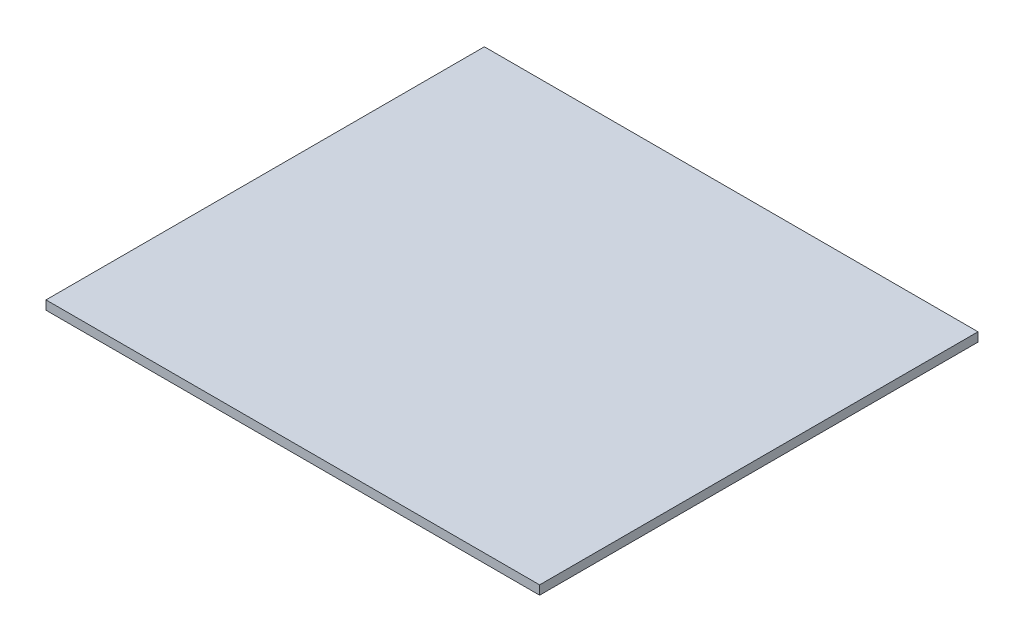
ISO-10303-21;
HEADER;
FILE_DESCRIPTION(('STEP AP214'),'2;1');
FILE_NAME('part.step','',(''),(''),'','','');
FILE_SCHEMA(('AUTOMOTIVE_DESIGN { 1 0 10303 214 1 1 1 1 }'));
ENDSEC;
DATA;
#1=APPLICATION_CONTEXT('core data for automotive mechanical design processes');
#2=APPLICATION_PROTOCOL_DEFINITION('international standard','automotive_design',2000,#1);
#3=PRODUCT_CONTEXT('',#1,'mechanical');
#4=PRODUCT('Part','Part','',(#3));
#5=PRODUCT_RELATED_PRODUCT_CATEGORY('part','',(#4));
#6=PRODUCT_DEFINITION_FORMATION('','',#4);
#7=PRODUCT_DEFINITION_CONTEXT('part definition',#1,'design');
#8=PRODUCT_DEFINITION('design','',#6,#7);
#9=PRODUCT_DEFINITION_SHAPE('','',#8);
#10=(LENGTH_UNIT() NAMED_UNIT(*) SI_UNIT(.MILLI.,.METRE.));
#11=(NAMED_UNIT(*) PLANE_ANGLE_UNIT() SI_UNIT($,.RADIAN.));
#12=(NAMED_UNIT(*) SI_UNIT($,.STERADIAN.) SOLID_ANGLE_UNIT());
#13=UNCERTAINTY_MEASURE_WITH_UNIT(LENGTH_MEASURE(1.E-05),#10,'distance_accuracy_value','');
#14=(GEOMETRIC_REPRESENTATION_CONTEXT(3) GLOBAL_UNCERTAINTY_ASSIGNED_CONTEXT((#13)) GLOBAL_UNIT_ASSIGNED_CONTEXT((#10,
#11,#12)) REPRESENTATION_CONTEXT('',''));
#15=CARTESIAN_POINT('',(0.,0.,0.));
#16=DIRECTION('',(0.,0.,1.));
#17=DIRECTION('',(1.,0.,0.));
#18=AXIS2_PLACEMENT_3D('',#15,#16,#17);
#19=CARTESIAN_POINT('',(35.75,1.3,-31.75));
#20=DIRECTION('',(-1.,0.,0.));
#21=DIRECTION('',(0.,0.,1.));
#22=AXIS2_PLACEMENT_3D('',#19,#20,#21);
#23=PLANE('',#22);
#24=DIRECTION('',(0.,0.,-1.));
#25=VECTOR('',#24,1.);
#26=CARTESIAN_POINT('',(35.75,0.,-31.75));
#27=LINE('',#26,#25);
#28=CARTESIAN_POINT('',(35.75,0.,31.75));
#29=VERTEX_POINT('',#28);
#30=CARTESIAN_POINT('',(35.75,0.,-31.75));
#31=VERTEX_POINT('',#30);
#32=EDGE_CURVE('E97',#29,#31,#27,.T.);
#33=ORIENTED_EDGE('',*,*,#32,.T.);
#34=DIRECTION('',(0.,-1.,0.));
#35=VECTOR('',#34,1.);
#36=CARTESIAN_POINT('',(35.75,1.3,-31.75));
#37=LINE('',#36,#35);
#38=CARTESIAN_POINT('',(35.75,1.3,-31.75));
#39=VERTEX_POINT('',#38);
#40=EDGE_CURVE('E11',#39,#31,#37,.T.);
#41=ORIENTED_EDGE('',*,*,#40,.F.);
#42=DIRECTION('',(0.,0.,-1.));
#43=VECTOR('',#42,1.);
#44=CARTESIAN_POINT('',(35.75,1.3,-31.75));
#45=LINE('',#44,#43);
#46=CARTESIAN_POINT('',(35.75,1.3,31.75));
#47=VERTEX_POINT('',#46);
#48=EDGE_CURVE('E85',#47,#39,#45,.T.);
#49=ORIENTED_EDGE('',*,*,#48,.F.);
#50=DIRECTION('',(0.,-1.,0.));
#51=VECTOR('',#50,1.);
#52=CARTESIAN_POINT('',(35.75,1.3,31.75));
#53=LINE('',#52,#51);
#54=EDGE_CURVE('E93',#47,#29,#53,.T.);
#55=ORIENTED_EDGE('',*,*,#54,.T.);
#56=EDGE_LOOP('',(#33,#41,#49,#55));
#57=FACE_BOUND('',#56,.T.);
#58=ADVANCED_FACE('F34',(#57),#23,.F.);
#59=CARTESIAN_POINT('',(-35.75,1.3,-31.75));
#60=DIRECTION('',(0.,0.,1.));
#61=DIRECTION('',(1.,0.,0.));
#62=AXIS2_PLACEMENT_3D('',#59,#60,#61);
#63=PLANE('',#62);
#64=DIRECTION('',(-1.,0.,0.));
#65=VECTOR('',#64,1.);
#66=CARTESIAN_POINT('',(-35.75,0.,-31.75));
#67=LINE('',#66,#65);
#68=CARTESIAN_POINT('',(-35.75,0.,-31.75));
#69=VERTEX_POINT('',#68);
#70=EDGE_CURVE('E89',#31,#69,#67,.T.);
#71=ORIENTED_EDGE('',*,*,#70,.T.);
#72=DIRECTION('',(0.,-1.,0.));
#73=VECTOR('',#72,1.);
#74=CARTESIAN_POINT('',(-35.75,1.3,-31.75));
#75=LINE('',#74,#73);
#76=CARTESIAN_POINT('',(-35.75,1.3,-31.75));
#77=VERTEX_POINT('',#76);
#78=EDGE_CURVE('E42',#77,#69,#75,.T.);
#79=ORIENTED_EDGE('',*,*,#78,.F.);
#80=DIRECTION('',(-1.,0.,0.));
#81=VECTOR('',#80,1.);
#82=CARTESIAN_POINT('',(-35.75,1.3,-31.75));
#83=LINE('',#82,#81);
#84=EDGE_CURVE('E80',#39,#77,#83,.T.);
#85=ORIENTED_EDGE('',*,*,#84,.F.);
#86=ORIENTED_EDGE('',*,*,#40,.T.);
#87=EDGE_LOOP('',(#71,#79,#85,#86));
#88=FACE_BOUND('',#87,.T.);
#89=ADVANCED_FACE('F88',(#88),#63,.F.);
#90=CARTESIAN_POINT('',(-35.75,1.3,-31.75));
#91=DIRECTION('',(1.,0.,0.));
#92=DIRECTION('',(0.,0.,-1.));
#93=AXIS2_PLACEMENT_3D('',#90,#91,#92);
#94=PLANE('',#93);
#95=DIRECTION('',(0.,0.,1.));
#96=VECTOR('',#95,1.);
#97=CARTESIAN_POINT('',(-35.75,0.,-31.75));
#98=LINE('',#97,#96);
#99=CARTESIAN_POINT('',(-35.75,0.,31.75));
#100=VERTEX_POINT('',#99);
#101=EDGE_CURVE('E67',#69,#100,#98,.T.);
#102=ORIENTED_EDGE('',*,*,#101,.T.);
#103=DIRECTION('',(0.,-1.,0.));
#104=VECTOR('',#103,1.);
#105=CARTESIAN_POINT('',(-35.75,1.3,31.75));
#106=LINE('',#105,#104);
#107=CARTESIAN_POINT('',(-35.75,1.3,31.75));
#108=VERTEX_POINT('',#107);
#109=EDGE_CURVE('E90',#108,#100,#106,.T.);
#110=ORIENTED_EDGE('',*,*,#109,.F.);
#111=DIRECTION('',(0.,0.,1.));
#112=VECTOR('',#111,1.);
#113=CARTESIAN_POINT('',(-35.75,1.3,-31.75));
#114=LINE('',#113,#112);
#115=EDGE_CURVE('E83',#77,#108,#114,.T.);
#116=ORIENTED_EDGE('',*,*,#115,.F.);
#117=ORIENTED_EDGE('',*,*,#78,.T.);
#118=EDGE_LOOP('',(#102,#110,#116,#117));
#119=FACE_BOUND('',#118,.T.);
#120=ADVANCED_FACE('F91',(#119),#94,.F.);
#121=CARTESIAN_POINT('',(-35.75,1.3,31.75));
#122=DIRECTION('',(0.,0.,-1.));
#123=DIRECTION('',(-1.,0.,0.));
#124=AXIS2_PLACEMENT_3D('',#121,#122,#123);
#125=PLANE('',#124);
#126=DIRECTION('',(1.,0.,0.));
#127=VECTOR('',#126,1.);
#128=CARTESIAN_POINT('',(-35.75,0.,31.75));
#129=LINE('',#128,#127);
#130=EDGE_CURVE('E73',#100,#29,#129,.T.);
#131=ORIENTED_EDGE('',*,*,#130,.T.);
#132=ORIENTED_EDGE('',*,*,#54,.F.);
#133=DIRECTION('',(1.,0.,0.));
#134=VECTOR('',#133,1.);
#135=CARTESIAN_POINT('',(-35.75,1.3,31.75));
#136=LINE('',#135,#134);
#137=EDGE_CURVE('E50',#108,#47,#136,.T.);
#138=ORIENTED_EDGE('',*,*,#137,.F.);
#139=ORIENTED_EDGE('',*,*,#109,.T.);
#140=EDGE_LOOP('',(#131,#132,#138,#139));
#141=FACE_BOUND('',#140,.T.);
#142=ADVANCED_FACE('F104',(#141),#125,.F.);
#143=CARTESIAN_POINT('',(0.,1.3,0.));
#144=DIRECTION('',(0.,1.,0.));
#145=DIRECTION('',(0.,0.,1.));
#146=AXIS2_PLACEMENT_3D('',#143,#144,#145);
#147=PLANE('',#146);
#148=ORIENTED_EDGE('',*,*,#48,.T.);
#149=ORIENTED_EDGE('',*,*,#84,.T.);
#150=ORIENTED_EDGE('',*,*,#115,.T.);
#151=ORIENTED_EDGE('',*,*,#137,.T.);
#152=EDGE_LOOP('',(#148,#149,#150,#151));
#153=FACE_BOUND('',#152,.T.);
#154=ADVANCED_FACE('F81',(#153),#147,.T.);
#155=CARTESIAN_POINT('',(0.,0.,0.));
#156=DIRECTION('',(0.,1.,0.));
#157=DIRECTION('',(0.,0.,1.));
#158=AXIS2_PLACEMENT_3D('',#155,#156,#157);
#159=PLANE('',#158);
#160=ORIENTED_EDGE('',*,*,#32,.F.);
#161=ORIENTED_EDGE('',*,*,#130,.F.);
#162=ORIENTED_EDGE('',*,*,#101,.F.);
#163=ORIENTED_EDGE('',*,*,#70,.F.);
#164=EDGE_LOOP('',(#160,#161,#162,#163));
#165=FACE_BOUND('',#164,.T.);
#166=ADVANCED_FACE('F107',(#165),#159,.F.);
#167=CLOSED_SHELL('',(#58,#89,#120,#142,#154,#166));
#168=MANIFOLD_SOLID_BREP('B2',#167);
#169=ADVANCED_BREP_SHAPE_REPRESENTATION('',(#18,#168),#14);
#170=SHAPE_DEFINITION_REPRESENTATION(#9,#169);
ENDSEC;
END-ISO-10303-21;
